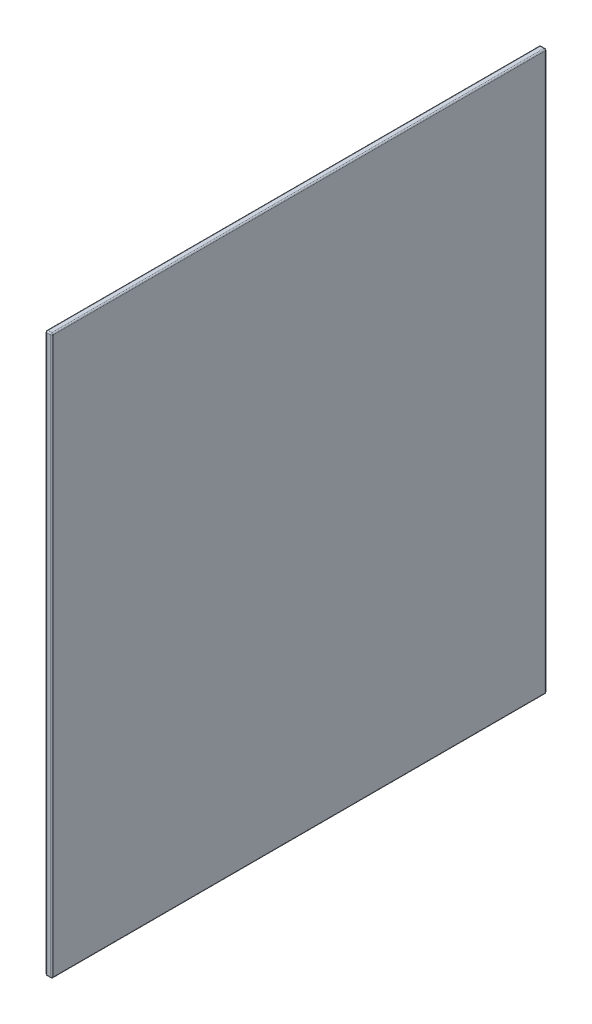
ISO-10303-21;
HEADER;
FILE_DESCRIPTION(('STEP AP214'),'2;1');
FILE_NAME('part.step','',(''),(''),'','','');
FILE_SCHEMA(('AUTOMOTIVE_DESIGN { 1 0 10303 214 1 1 1 1 }'));
ENDSEC;
DATA;
#1=APPLICATION_CONTEXT('core data for automotive mechanical design processes');
#2=APPLICATION_PROTOCOL_DEFINITION('international standard','automotive_design',2000,#1);
#3=PRODUCT_CONTEXT('',#1,'mechanical');
#4=PRODUCT('Part','Part','',(#3));
#5=PRODUCT_RELATED_PRODUCT_CATEGORY('part','',(#4));
#6=PRODUCT_DEFINITION_FORMATION('','',#4);
#7=PRODUCT_DEFINITION_CONTEXT('part definition',#1,'design');
#8=PRODUCT_DEFINITION('design','',#6,#7);
#9=PRODUCT_DEFINITION_SHAPE('','',#8);
#10=(LENGTH_UNIT() NAMED_UNIT(*) SI_UNIT(.MILLI.,.METRE.));
#11=(NAMED_UNIT(*) PLANE_ANGLE_UNIT() SI_UNIT($,.RADIAN.));
#12=(NAMED_UNIT(*) SI_UNIT($,.STERADIAN.) SOLID_ANGLE_UNIT());
#13=UNCERTAINTY_MEASURE_WITH_UNIT(LENGTH_MEASURE(1.E-05),#10,'distance_accuracy_value','');
#14=(GEOMETRIC_REPRESENTATION_CONTEXT(3) GLOBAL_UNCERTAINTY_ASSIGNED_CONTEXT((#13)) GLOBAL_UNIT_ASSIGNED_CONTEXT((#10,
#11,#12)) REPRESENTATION_CONTEXT('',''));
#15=CARTESIAN_POINT('',(0.,0.,0.));
#16=DIRECTION('',(0.,0.,1.));
#17=DIRECTION('',(1.,0.,0.));
#18=AXIS2_PLACEMENT_3D('',#15,#16,#17);
#19=CARTESIAN_POINT('',(4.7625,-207.9625,-184.15));
#20=DIRECTION('',(0.,0.,1.));
#21=DIRECTION('',(1.,0.,0.));
#22=AXIS2_PLACEMENT_3D('',#19,#20,#21);
#23=PLANE('',#22);
#24=DIRECTION('',(0.,1.,0.));
#25=VECTOR('',#24,1.);
#26=CARTESIAN_POINT('',(1.016,207.9625,-184.15));
#27=LINE('',#26,#25);
#28=CARTESIAN_POINT('',(1.016,-206.9465,-184.15));
#29=VERTEX_POINT('',#28);
#30=CARTESIAN_POINT('',(1.016,206.9465,-184.15));
#31=VERTEX_POINT('',#30);
#32=EDGE_CURVE('E279',#29,#31,#27,.T.);
#33=ORIENTED_EDGE('',*,*,#32,.T.);
#34=DIRECTION('',(-1.,0.,0.));
#35=VECTOR('',#34,1.);
#36=CARTESIAN_POINT('',(4.7625,206.9465,-184.15));
#37=LINE('',#36,#35);
#38=CARTESIAN_POINT('',(3.7465,206.9465,-184.15));
#39=VERTEX_POINT('',#38);
#40=EDGE_CURVE('E213',#31,#39,#37,.F.);
#41=ORIENTED_EDGE('',*,*,#40,.T.);
#42=DIRECTION('',(0.,1.,0.));
#43=VECTOR('',#42,1.);
#44=CARTESIAN_POINT('',(3.7465,-207.9625,-184.15));
#45=LINE('',#44,#43);
#46=CARTESIAN_POINT('',(3.7465,-206.9465,-184.15));
#47=VERTEX_POINT('',#46);
#48=EDGE_CURVE('E275',#39,#47,#45,.F.);
#49=ORIENTED_EDGE('',*,*,#48,.T.);
#50=DIRECTION('',(-1.,0.,0.));
#51=VECTOR('',#50,1.);
#52=CARTESIAN_POINT('',(4.7625,-206.9465,-184.15));
#53=LINE('',#52,#51);
#54=EDGE_CURVE('E210',#47,#29,#53,.T.);
#55=ORIENTED_EDGE('',*,*,#54,.T.);
#56=EDGE_LOOP('',(#33,#41,#49,#55));
#57=FACE_BOUND('',#56,.T.);
#58=ADVANCED_FACE('F41',(#57),#23,.F.);
#59=CARTESIAN_POINT('',(4.7625,207.9625,184.15));
#60=DIRECTION('',(0.,-1.,0.));
#61=DIRECTION('',(0.,0.,-1.));
#62=AXIS2_PLACEMENT_3D('',#59,#60,#61);
#63=PLANE('',#62);
#64=DIRECTION('',(0.,0.,1.));
#65=VECTOR('',#64,1.);
#66=CARTESIAN_POINT('',(3.7465,207.9625,184.15));
#67=LINE('',#66,#65);
#68=CARTESIAN_POINT('',(3.7465,207.9625,183.134));
#69=VERTEX_POINT('',#68);
#70=CARTESIAN_POINT('',(3.7465,207.9625,-183.134));
#71=VERTEX_POINT('',#70);
#72=EDGE_CURVE('E231',#69,#71,#67,.F.);
#73=ORIENTED_EDGE('',*,*,#72,.T.);
#74=DIRECTION('',(-1.,0.,0.));
#75=VECTOR('',#74,1.);
#76=CARTESIAN_POINT('',(4.7625,207.9625,-183.134));
#77=LINE('',#76,#75);
#78=CARTESIAN_POINT('',(1.016,207.9625,-183.134));
#79=VERTEX_POINT('',#78);
#80=EDGE_CURVE('E207',#71,#79,#77,.T.);
#81=ORIENTED_EDGE('',*,*,#80,.T.);
#82=DIRECTION('',(0.,0.,1.));
#83=VECTOR('',#82,1.);
#84=CARTESIAN_POINT('',(1.016,207.9625,184.15));
#85=LINE('',#84,#83);
#86=CARTESIAN_POINT('',(1.016,207.9625,183.134));
#87=VERTEX_POINT('',#86);
#88=EDGE_CURVE('E141',#79,#87,#85,.T.);
#89=ORIENTED_EDGE('',*,*,#88,.T.);
#90=DIRECTION('',(-1.,0.,0.));
#91=VECTOR('',#90,1.);
#92=CARTESIAN_POINT('',(4.7625,207.9625,183.134));
#93=LINE('',#92,#91);
#94=EDGE_CURVE('E204',#87,#69,#93,.F.);
#95=ORIENTED_EDGE('',*,*,#94,.T.);
#96=EDGE_LOOP('',(#73,#81,#89,#95));
#97=FACE_BOUND('',#96,.T.);
#98=ADVANCED_FACE('F314',(#97),#63,.F.);
#99=CARTESIAN_POINT('',(4.7625,-207.9625,184.15));
#100=DIRECTION('',(0.,0.,-1.));
#101=DIRECTION('',(-1.,0.,0.));
#102=AXIS2_PLACEMENT_3D('',#99,#100,#101);
#103=PLANE('',#102);
#104=DIRECTION('',(0.,-1.,0.));
#105=VECTOR('',#104,1.);
#106=CARTESIAN_POINT('',(1.016,-207.9625,184.15));
#107=LINE('',#106,#105);
#108=CARTESIAN_POINT('',(1.016,206.9465,184.15));
#109=VERTEX_POINT('',#108);
#110=CARTESIAN_POINT('',(1.016,-206.9465,184.15));
#111=VERTEX_POINT('',#110);
#112=EDGE_CURVE('E260',#109,#111,#107,.T.);
#113=ORIENTED_EDGE('',*,*,#112,.T.);
#114=DIRECTION('',(-1.,0.,0.));
#115=VECTOR('',#114,1.);
#116=CARTESIAN_POINT('',(4.7625,-206.9465,184.15));
#117=LINE('',#116,#115);
#118=CARTESIAN_POINT('',(3.7465,-206.9465,184.15));
#119=VERTEX_POINT('',#118);
#120=EDGE_CURVE('E11',#111,#119,#117,.F.);
#121=ORIENTED_EDGE('',*,*,#120,.T.);
#122=DIRECTION('',(0.,-1.,0.));
#123=VECTOR('',#122,1.);
#124=CARTESIAN_POINT('',(3.7465,-207.9625,184.15));
#125=LINE('',#124,#123);
#126=CARTESIAN_POINT('',(3.7465,206.9465,184.15));
#127=VERTEX_POINT('',#126);
#128=EDGE_CURVE('E168',#119,#127,#125,.F.);
#129=ORIENTED_EDGE('',*,*,#128,.T.);
#130=DIRECTION('',(-1.,0.,0.));
#131=VECTOR('',#130,1.);
#132=CARTESIAN_POINT('',(4.7625,206.9465,184.15));
#133=LINE('',#132,#131);
#134=EDGE_CURVE('E51',#127,#109,#133,.T.);
#135=ORIENTED_EDGE('',*,*,#134,.T.);
#136=EDGE_LOOP('',(#113,#121,#129,#135));
#137=FACE_BOUND('',#136,.T.);
#138=ADVANCED_FACE('F358',(#137),#103,.F.);
#139=CARTESIAN_POINT('',(4.7625,-207.9625,184.15));
#140=DIRECTION('',(0.,1.,0.));
#141=DIRECTION('',(0.,0.,1.));
#142=AXIS2_PLACEMENT_3D('',#139,#140,#141);
#143=PLANE('',#142);
#144=DIRECTION('',(0.,0.,-1.));
#145=VECTOR('',#144,1.);
#146=CARTESIAN_POINT('',(1.016,-207.9625,-184.15));
#147=LINE('',#146,#145);
#148=CARTESIAN_POINT('',(1.016,-207.9625,183.134));
#149=VERTEX_POINT('',#148);
#150=CARTESIAN_POINT('',(1.016,-207.9625,-183.134));
#151=VERTEX_POINT('',#150);
#152=EDGE_CURVE('E268',#149,#151,#147,.T.);
#153=ORIENTED_EDGE('',*,*,#152,.T.);
#154=DIRECTION('',(-1.,0.,0.));
#155=VECTOR('',#154,1.);
#156=CARTESIAN_POINT('',(4.7625,-207.9625,-183.134));
#157=LINE('',#156,#155);
#158=CARTESIAN_POINT('',(3.7465,-207.9625,-183.134));
#159=VERTEX_POINT('',#158);
#160=EDGE_CURVE('E219',#151,#159,#157,.F.);
#161=ORIENTED_EDGE('',*,*,#160,.T.);
#162=DIRECTION('',(0.,0.,-1.));
#163=VECTOR('',#162,1.);
#164=CARTESIAN_POINT('',(3.7465,-207.9625,184.15));
#165=LINE('',#164,#163);
#166=CARTESIAN_POINT('',(3.7465,-207.9625,183.134));
#167=VERTEX_POINT('',#166);
#168=EDGE_CURVE('E263',#159,#167,#165,.F.);
#169=ORIENTED_EDGE('',*,*,#168,.T.);
#170=DIRECTION('',(-1.,0.,0.));
#171=VECTOR('',#170,1.);
#172=CARTESIAN_POINT('',(4.7625,-207.9625,183.134));
#173=LINE('',#172,#171);
#174=EDGE_CURVE('E216',#167,#149,#173,.T.);
#175=ORIENTED_EDGE('',*,*,#174,.T.);
#176=EDGE_LOOP('',(#153,#161,#169,#175));
#177=FACE_BOUND('',#176,.T.);
#178=ADVANCED_FACE('F341',(#177),#143,.F.);
#179=CARTESIAN_POINT('',(4.7625,0.,0.));
#180=DIRECTION('',(-1.,0.,0.));
#181=DIRECTION('',(0.,0.,1.));
#182=AXIS2_PLACEMENT_3D('',#179,#180,#181);
#183=PLANE('',#182);
#184=DIRECTION('',(0.,-1.,0.));
#185=VECTOR('',#184,1.);
#186=CARTESIAN_POINT('',(4.7625,0.,183.134));
#187=LINE('',#186,#185);
#188=CARTESIAN_POINT('',(4.7625,206.9465,183.134));
#189=VERTEX_POINT('',#188);
#190=CARTESIAN_POINT('',(4.7625,-206.9465,183.134));
#191=VERTEX_POINT('',#190);
#192=EDGE_CURVE('E290',#189,#191,#187,.T.);
#193=ORIENTED_EDGE('',*,*,#192,.T.);
#194=DIRECTION('',(0.,0.,-1.));
#195=VECTOR('',#194,1.);
#196=CARTESIAN_POINT('',(4.7625,-206.9465,0.));
#197=LINE('',#196,#195);
#198=CARTESIAN_POINT('',(4.7625,-206.9465,-183.134));
#199=VERTEX_POINT('',#198);
#200=EDGE_CURVE('E294',#191,#199,#197,.T.);
#201=ORIENTED_EDGE('',*,*,#200,.T.);
#202=DIRECTION('',(0.,1.,0.));
#203=VECTOR('',#202,1.);
#204=CARTESIAN_POINT('',(4.7625,0.,-183.134));
#205=LINE('',#204,#203);
#206=CARTESIAN_POINT('',(4.7625,206.9465,-183.134));
#207=VERTEX_POINT('',#206);
#208=EDGE_CURVE('E282',#199,#207,#205,.T.);
#209=ORIENTED_EDGE('',*,*,#208,.T.);
#210=DIRECTION('',(0.,0.,1.));
#211=VECTOR('',#210,1.);
#212=CARTESIAN_POINT('',(4.7625,206.9465,0.));
#213=LINE('',#212,#211);
#214=EDGE_CURVE('E286',#207,#189,#213,.T.);
#215=ORIENTED_EDGE('',*,*,#214,.T.);
#216=EDGE_LOOP('',(#193,#201,#209,#215));
#217=FACE_BOUND('',#216,.T.);
#218=ADVANCED_FACE('F367',(#217),#183,.F.);
#219=CARTESIAN_POINT('',(0.,0.,0.));
#220=DIRECTION('',(-1.,0.,0.));
#221=DIRECTION('',(0.,0.,1.));
#222=AXIS2_PLACEMENT_3D('',#219,#220,#221);
#223=PLANE('',#222);
#224=DIRECTION('',(0.,-1.,0.));
#225=VECTOR('',#224,1.);
#226=CARTESIAN_POINT('',(0.,207.9625,183.134));
#227=LINE('',#226,#225);
#228=CARTESIAN_POINT('',(0.,-206.9465,183.134));
#229=VERTEX_POINT('',#228);
#230=CARTESIAN_POINT('',(0.,206.9465,183.134));
#231=VERTEX_POINT('',#230);
#232=EDGE_CURVE('E166',#229,#231,#227,.F.);
#233=ORIENTED_EDGE('',*,*,#232,.T.);
#234=DIRECTION('',(0.,0.,1.));
#235=VECTOR('',#234,1.);
#236=CARTESIAN_POINT('',(0.,206.9465,-184.15));
#237=LINE('',#236,#235);
#238=CARTESIAN_POINT('',(0.,206.9465,-183.134));
#239=VERTEX_POINT('',#238);
#240=EDGE_CURVE('E138',#231,#239,#237,.F.);
#241=ORIENTED_EDGE('',*,*,#240,.T.);
#242=DIRECTION('',(0.,1.,0.));
#243=VECTOR('',#242,1.);
#244=CARTESIAN_POINT('',(0.,-207.9625,-183.134));
#245=LINE('',#244,#243);
#246=CARTESIAN_POINT('',(0.,-206.9465,-183.134));
#247=VERTEX_POINT('',#246);
#248=EDGE_CURVE('E152',#239,#247,#245,.F.);
#249=ORIENTED_EDGE('',*,*,#248,.T.);
#250=DIRECTION('',(0.,0.,-1.));
#251=VECTOR('',#250,1.);
#252=CARTESIAN_POINT('',(0.,-206.9465,184.15));
#253=LINE('',#252,#251);
#254=EDGE_CURVE('E162',#247,#229,#253,.F.);
#255=ORIENTED_EDGE('',*,*,#254,.T.);
#256=EDGE_LOOP('',(#233,#241,#249,#255));
#257=FACE_BOUND('',#256,.T.);
#258=ADVANCED_FACE('F165',(#257),#223,.T.);
#259=CARTESIAN_POINT('',(1.016,-206.9465,184.15));
#260=DIRECTION('',(0.,0.,1.));
#261=DIRECTION('',(1.,0.,0.));
#262=AXIS2_PLACEMENT_3D('',#259,#260,#261);
#263=CYLINDRICAL_SURFACE('',#262,1.016);
#264=ORIENTED_EDGE('',*,*,#254,.F.);
#265=CARTESIAN_POINT('',(1.016,-206.9465,-183.134));
#266=DIRECTION('',(0.,0.,1.));
#267=DIRECTION('',(1.,0.,0.));
#268=AXIS2_PLACEMENT_3D('',#265,#266,#267);
#269=CIRCLE('',#268,1.016);
#270=EDGE_CURVE('E189',#247,#151,#269,.T.);
#271=ORIENTED_EDGE('',*,*,#270,.T.);
#272=ORIENTED_EDGE('',*,*,#152,.F.);
#273=CARTESIAN_POINT('',(1.016,-206.9465,183.134));
#274=DIRECTION('',(0.,0.,1.));
#275=DIRECTION('',(1.,0.,0.));
#276=AXIS2_PLACEMENT_3D('',#273,#274,#275);
#277=CIRCLE('',#276,1.016);
#278=EDGE_CURVE('E186',#149,#229,#277,.F.);
#279=ORIENTED_EDGE('',*,*,#278,.T.);
#280=EDGE_LOOP('',(#264,#271,#272,#279));
#281=FACE_BOUND('',#280,.T.);
#282=ADVANCED_FACE('F327',(#281),#263,.T.);
#283=CARTESIAN_POINT('',(1.016,-207.9625,-183.134));
#284=DIRECTION('',(0.,-1.,0.));
#285=DIRECTION('',(0.,0.,-1.));
#286=AXIS2_PLACEMENT_3D('',#283,#284,#285);
#287=CYLINDRICAL_SURFACE('',#286,1.016);
#288=ORIENTED_EDGE('',*,*,#248,.F.);
#289=CARTESIAN_POINT('',(1.016,206.9465,-183.134));
#290=DIRECTION('',(0.,-1.,0.));
#291=DIRECTION('',(0.,0.,-1.));
#292=AXIS2_PLACEMENT_3D('',#289,#290,#291);
#293=CIRCLE('',#292,1.016);
#294=EDGE_CURVE('E155',#239,#31,#293,.T.);
#295=ORIENTED_EDGE('',*,*,#294,.T.);
#296=ORIENTED_EDGE('',*,*,#32,.F.);
#297=CARTESIAN_POINT('',(1.016,-206.9465,-183.134));
#298=DIRECTION('',(0.,-1.,0.));
#299=DIRECTION('',(0.,0.,-1.));
#300=AXIS2_PLACEMENT_3D('',#297,#298,#299);
#301=CIRCLE('',#300,1.016);
#302=EDGE_CURVE('E147',#29,#247,#301,.F.);
#303=ORIENTED_EDGE('',*,*,#302,.T.);
#304=EDGE_LOOP('',(#288,#295,#296,#303));
#305=FACE_BOUND('',#304,.T.);
#306=ADVANCED_FACE('F153',(#305),#287,.T.);
#307=CARTESIAN_POINT('',(1.016,-207.9625,183.134));
#308=DIRECTION('',(0.,1.,0.));
#309=DIRECTION('',(0.,0.,1.));
#310=AXIS2_PLACEMENT_3D('',#307,#308,#309);
#311=CYLINDRICAL_SURFACE('',#310,1.016);
#312=ORIENTED_EDGE('',*,*,#232,.F.);
#313=CARTESIAN_POINT('',(1.016,-206.9465,183.134));
#314=DIRECTION('',(0.,1.,0.));
#315=DIRECTION('',(0.,0.,1.));
#316=AXIS2_PLACEMENT_3D('',#313,#314,#315);
#317=CIRCLE('',#316,1.016);
#318=EDGE_CURVE('E59',#229,#111,#317,.T.);
#319=ORIENTED_EDGE('',*,*,#318,.T.);
#320=ORIENTED_EDGE('',*,*,#112,.F.);
#321=CARTESIAN_POINT('',(1.016,206.9465,183.134));
#322=DIRECTION('',(0.,1.,0.));
#323=DIRECTION('',(0.,0.,1.));
#324=AXIS2_PLACEMENT_3D('',#321,#322,#323);
#325=CIRCLE('',#324,1.016);
#326=EDGE_CURVE('E199',#109,#231,#325,.F.);
#327=ORIENTED_EDGE('',*,*,#326,.T.);
#328=EDGE_LOOP('',(#312,#319,#320,#327));
#329=FACE_BOUND('',#328,.T.);
#330=ADVANCED_FACE('F259',(#329),#311,.T.);
#331=CARTESIAN_POINT('',(1.016,206.9465,184.15));
#332=DIRECTION('',(0.,0.,-1.));
#333=DIRECTION('',(-1.,0.,0.));
#334=AXIS2_PLACEMENT_3D('',#331,#332,#333);
#335=CYLINDRICAL_SURFACE('',#334,1.016);
#336=ORIENTED_EDGE('',*,*,#88,.F.);
#337=CARTESIAN_POINT('',(1.016,206.9465,-183.134));
#338=DIRECTION('',(0.,0.,-1.));
#339=DIRECTION('',(-1.,0.,0.));
#340=AXIS2_PLACEMENT_3D('',#337,#338,#339);
#341=CIRCLE('',#340,1.016);
#342=EDGE_CURVE('E134',#79,#239,#341,.F.);
#343=ORIENTED_EDGE('',*,*,#342,.T.);
#344=ORIENTED_EDGE('',*,*,#240,.F.);
#345=CARTESIAN_POINT('',(1.016,206.9465,183.134));
#346=DIRECTION('',(0.,0.,-1.));
#347=DIRECTION('',(-1.,0.,0.));
#348=AXIS2_PLACEMENT_3D('',#345,#346,#347);
#349=CIRCLE('',#348,1.016);
#350=EDGE_CURVE('E148',#231,#87,#349,.T.);
#351=ORIENTED_EDGE('',*,*,#350,.T.);
#352=EDGE_LOOP('',(#336,#343,#344,#351));
#353=FACE_BOUND('',#352,.T.);
#354=ADVANCED_FACE('F136',(#353),#335,.T.);
#355=CARTESIAN_POINT('',(3.7465,206.9465,0.));
#356=DIRECTION('',(0.,0.,1.));
#357=DIRECTION('',(1.,0.,0.));
#358=AXIS2_PLACEMENT_3D('',#355,#356,#357);
#359=CYLINDRICAL_SURFACE('',#358,1.016);
#360=ORIENTED_EDGE('',*,*,#214,.F.);
#361=CARTESIAN_POINT('',(3.7465,206.9465,-183.134));
#362=DIRECTION('',(0.,0.,1.));
#363=DIRECTION('',(1.,0.,0.));
#364=AXIS2_PLACEMENT_3D('',#361,#362,#363);
#365=CIRCLE('',#364,1.016);
#366=EDGE_CURVE('E308',#207,#71,#365,.T.);
#367=ORIENTED_EDGE('',*,*,#366,.T.);
#368=ORIENTED_EDGE('',*,*,#72,.F.);
#369=CARTESIAN_POINT('',(3.7465,206.9465,183.134));
#370=DIRECTION('',(0.,0.,1.));
#371=DIRECTION('',(1.,0.,0.));
#372=AXIS2_PLACEMENT_3D('',#369,#370,#371);
#373=CIRCLE('',#372,1.016);
#374=EDGE_CURVE('E305',#69,#189,#373,.F.);
#375=ORIENTED_EDGE('',*,*,#374,.T.);
#376=EDGE_LOOP('',(#360,#367,#368,#375));
#377=FACE_BOUND('',#376,.T.);
#378=ADVANCED_FACE('F365',(#377),#359,.T.);
#379=CARTESIAN_POINT('',(3.7465,0.,183.134));
#380=DIRECTION('',(0.,-1.,0.));
#381=DIRECTION('',(0.,0.,-1.));
#382=AXIS2_PLACEMENT_3D('',#379,#380,#381);
#383=CYLINDRICAL_SURFACE('',#382,1.016);
#384=ORIENTED_EDGE('',*,*,#128,.F.);
#385=CARTESIAN_POINT('',(3.7465,-206.9465,183.134));
#386=DIRECTION('',(0.,-1.,0.));
#387=DIRECTION('',(0.,0.,-1.));
#388=AXIS2_PLACEMENT_3D('',#385,#386,#387);
#389=CIRCLE('',#388,1.016);
#390=EDGE_CURVE('E196',#119,#191,#389,.F.);
#391=ORIENTED_EDGE('',*,*,#390,.T.);
#392=ORIENTED_EDGE('',*,*,#192,.F.);
#393=CARTESIAN_POINT('',(3.7465,206.9465,183.134));
#394=DIRECTION('',(0.,-1.,0.));
#395=DIRECTION('',(0.,0.,-1.));
#396=AXIS2_PLACEMENT_3D('',#393,#394,#395);
#397=CIRCLE('',#396,1.016);
#398=EDGE_CURVE('E192',#189,#127,#397,.T.);
#399=ORIENTED_EDGE('',*,*,#398,.T.);
#400=EDGE_LOOP('',(#384,#391,#392,#399));
#401=FACE_BOUND('',#400,.T.);
#402=ADVANCED_FACE('F360',(#401),#383,.T.);
#403=CARTESIAN_POINT('',(3.7465,0.,-183.134));
#404=DIRECTION('',(0.,1.,0.));
#405=DIRECTION('',(0.,0.,1.));
#406=AXIS2_PLACEMENT_3D('',#403,#404,#405);
#407=CYLINDRICAL_SURFACE('',#406,1.016);
#408=ORIENTED_EDGE('',*,*,#48,.F.);
#409=CARTESIAN_POINT('',(3.7465,206.9465,-183.134));
#410=DIRECTION('',(0.,1.,0.));
#411=DIRECTION('',(0.,0.,1.));
#412=AXIS2_PLACEMENT_3D('',#409,#410,#411);
#413=CIRCLE('',#412,1.016);
#414=EDGE_CURVE('E301',#39,#207,#413,.F.);
#415=ORIENTED_EDGE('',*,*,#414,.T.);
#416=ORIENTED_EDGE('',*,*,#208,.F.);
#417=CARTESIAN_POINT('',(3.7465,-206.9465,-183.134));
#418=DIRECTION('',(0.,1.,0.));
#419=DIRECTION('',(0.,0.,1.));
#420=AXIS2_PLACEMENT_3D('',#417,#418,#419);
#421=CIRCLE('',#420,1.016);
#422=EDGE_CURVE('E298',#199,#47,#421,.T.);
#423=ORIENTED_EDGE('',*,*,#422,.T.);
#424=EDGE_LOOP('',(#408,#415,#416,#423));
#425=FACE_BOUND('',#424,.T.);
#426=ADVANCED_FACE('F370',(#425),#407,.T.);
#427=CARTESIAN_POINT('',(3.7465,-206.9465,0.));
#428=DIRECTION('',(0.,0.,-1.));
#429=DIRECTION('',(-1.,0.,0.));
#430=AXIS2_PLACEMENT_3D('',#427,#428,#429);
#431=CYLINDRICAL_SURFACE('',#430,1.016);
#432=ORIENTED_EDGE('',*,*,#168,.F.);
#433=CARTESIAN_POINT('',(3.7465,-206.9465,-183.134));
#434=DIRECTION('',(0.,0.,-1.));
#435=DIRECTION('',(-1.,0.,0.));
#436=AXIS2_PLACEMENT_3D('',#433,#434,#435);
#437=CIRCLE('',#436,1.016);
#438=EDGE_CURVE('E179',#159,#199,#437,.F.);
#439=ORIENTED_EDGE('',*,*,#438,.T.);
#440=ORIENTED_EDGE('',*,*,#200,.F.);
#441=CARTESIAN_POINT('',(3.7465,-206.9465,183.134));
#442=DIRECTION('',(0.,0.,-1.));
#443=DIRECTION('',(-1.,0.,0.));
#444=AXIS2_PLACEMENT_3D('',#441,#442,#443);
#445=CIRCLE('',#444,1.016);
#446=EDGE_CURVE('E174',#191,#167,#445,.T.);
#447=ORIENTED_EDGE('',*,*,#446,.T.);
#448=EDGE_LOOP('',(#432,#439,#440,#447));
#449=FACE_BOUND('',#448,.T.);
#450=ADVANCED_FACE('F343',(#449),#431,.T.);
#451=CARTESIAN_POINT('',(1.016,206.9465,-183.134));
#452=DIRECTION('',(0.,0.,1.));
#453=DIRECTION('',(1.,0.,0.));
#454=AXIS2_PLACEMENT_3D('',#451,#452,#453);
#455=SPHERICAL_SURFACE('',#454,1.016);
#456=ORIENTED_EDGE('',*,*,#294,.F.);
#457=ORIENTED_EDGE('',*,*,#342,.F.);
#458=CARTESIAN_POINT('',(1.016,206.9465,-183.134));
#459=DIRECTION('',(1.,0.,0.));
#460=DIRECTION('',(0.,0.,-1.));
#461=AXIS2_PLACEMENT_3D('',#458,#459,#460);
#462=CIRCLE('',#461,1.016);
#463=EDGE_CURVE('E171',#31,#79,#462,.T.);
#464=ORIENTED_EDGE('',*,*,#463,.F.);
#465=EDGE_LOOP('',(#456,#457,#464));
#466=FACE_BOUND('',#465,.T.);
#467=ADVANCED_FACE('F170',(#466),#455,.T.);
#468=CARTESIAN_POINT('',(4.7625,206.9465,-183.134));
#469=DIRECTION('',(-1.,0.,0.));
#470=DIRECTION('',(0.,0.,1.));
#471=AXIS2_PLACEMENT_3D('',#468,#469,#470);
#472=CYLINDRICAL_SURFACE('',#471,1.016);
#473=ORIENTED_EDGE('',*,*,#463,.T.);
#474=ORIENTED_EDGE('',*,*,#80,.F.);
#475=CARTESIAN_POINT('',(3.7465,206.9465,-183.134));
#476=DIRECTION('',(1.,0.,0.));
#477=DIRECTION('',(0.,0.,-1.));
#478=AXIS2_PLACEMENT_3D('',#475,#476,#477);
#479=CIRCLE('',#478,1.016);
#480=EDGE_CURVE('E224',#39,#71,#479,.T.);
#481=ORIENTED_EDGE('',*,*,#480,.F.);
#482=ORIENTED_EDGE('',*,*,#40,.F.);
#483=EDGE_LOOP('',(#473,#474,#481,#482));
#484=FACE_BOUND('',#483,.T.);
#485=ADVANCED_FACE('F376',(#484),#472,.T.);
#486=CARTESIAN_POINT('',(3.7465,206.9465,-183.134));
#487=DIRECTION('',(0.,0.,1.));
#488=DIRECTION('',(1.,0.,0.));
#489=AXIS2_PLACEMENT_3D('',#486,#487,#488);
#490=SPHERICAL_SURFACE('',#489,1.016);
#491=ORIENTED_EDGE('',*,*,#480,.T.);
#492=ORIENTED_EDGE('',*,*,#366,.F.);
#493=ORIENTED_EDGE('',*,*,#414,.F.);
#494=EDGE_LOOP('',(#491,#492,#493));
#495=FACE_BOUND('',#494,.T.);
#496=ADVANCED_FACE('F374',(#495),#490,.T.);
#497=CARTESIAN_POINT('',(1.016,-206.9465,-183.134));
#498=DIRECTION('',(0.,0.,1.));
#499=DIRECTION('',(1.,0.,0.));
#500=AXIS2_PLACEMENT_3D('',#497,#498,#499);
#501=SPHERICAL_SURFACE('',#500,1.016);
#502=ORIENTED_EDGE('',*,*,#270,.F.);
#503=ORIENTED_EDGE('',*,*,#302,.F.);
#504=CARTESIAN_POINT('',(1.016,-206.9465,-183.134));
#505=DIRECTION('',(1.,0.,0.));
#506=DIRECTION('',(0.,0.,-1.));
#507=AXIS2_PLACEMENT_3D('',#504,#505,#506);
#508=CIRCLE('',#507,1.016);
#509=EDGE_CURVE('E228',#151,#29,#508,.T.);
#510=ORIENTED_EDGE('',*,*,#509,.F.);
#511=EDGE_LOOP('',(#502,#503,#510));
#512=FACE_BOUND('',#511,.T.);
#513=ADVANCED_FACE('F332',(#512),#501,.T.);
#514=CARTESIAN_POINT('',(4.7625,-206.9465,-183.134));
#515=DIRECTION('',(-1.,0.,0.));
#516=DIRECTION('',(0.,0.,1.));
#517=AXIS2_PLACEMENT_3D('',#514,#515,#516);
#518=CYLINDRICAL_SURFACE('',#517,1.016);
#519=ORIENTED_EDGE('',*,*,#509,.T.);
#520=ORIENTED_EDGE('',*,*,#54,.F.);
#521=CARTESIAN_POINT('',(3.7465,-206.9465,-183.134));
#522=DIRECTION('',(1.,0.,0.));
#523=DIRECTION('',(0.,0.,-1.));
#524=AXIS2_PLACEMENT_3D('',#521,#522,#523);
#525=CIRCLE('',#524,1.016);
#526=EDGE_CURVE('E232',#159,#47,#525,.T.);
#527=ORIENTED_EDGE('',*,*,#526,.F.);
#528=ORIENTED_EDGE('',*,*,#160,.F.);
#529=EDGE_LOOP('',(#519,#520,#527,#528));
#530=FACE_BOUND('',#529,.T.);
#531=ADVANCED_FACE('F337',(#530),#518,.T.);
#532=CARTESIAN_POINT('',(3.7465,-206.9465,-183.134));
#533=DIRECTION('',(0.,0.,1.));
#534=DIRECTION('',(1.,0.,0.));
#535=AXIS2_PLACEMENT_3D('',#532,#533,#534);
#536=SPHERICAL_SURFACE('',#535,1.016);
#537=ORIENTED_EDGE('',*,*,#526,.T.);
#538=ORIENTED_EDGE('',*,*,#422,.F.);
#539=ORIENTED_EDGE('',*,*,#438,.F.);
#540=EDGE_LOOP('',(#537,#538,#539));
#541=FACE_BOUND('',#540,.T.);
#542=ADVANCED_FACE('F379',(#541),#536,.T.);
#543=CARTESIAN_POINT('',(1.016,-206.9465,183.134));
#544=DIRECTION('',(0.,0.,1.));
#545=DIRECTION('',(1.,0.,0.));
#546=AXIS2_PLACEMENT_3D('',#543,#544,#545);
#547=SPHERICAL_SURFACE('',#546,1.016);
#548=ORIENTED_EDGE('',*,*,#318,.F.);
#549=ORIENTED_EDGE('',*,*,#278,.F.);
#550=CARTESIAN_POINT('',(1.016,-206.9465,183.134));
#551=DIRECTION('',(1.,0.,0.));
#552=DIRECTION('',(0.,0.,-1.));
#553=AXIS2_PLACEMENT_3D('',#550,#551,#552);
#554=CIRCLE('',#553,1.016);
#555=EDGE_CURVE('E236',#111,#149,#554,.T.);
#556=ORIENTED_EDGE('',*,*,#555,.F.);
#557=EDGE_LOOP('',(#548,#549,#556));
#558=FACE_BOUND('',#557,.T.);
#559=ADVANCED_FACE('F356',(#558),#547,.T.);
#560=CARTESIAN_POINT('',(4.7625,-206.9465,183.134));
#561=DIRECTION('',(-1.,0.,0.));
#562=DIRECTION('',(0.,0.,1.));
#563=AXIS2_PLACEMENT_3D('',#560,#561,#562);
#564=CYLINDRICAL_SURFACE('',#563,1.016);
#565=ORIENTED_EDGE('',*,*,#555,.T.);
#566=ORIENTED_EDGE('',*,*,#174,.F.);
#567=CARTESIAN_POINT('',(3.7465,-206.9465,183.134));
#568=DIRECTION('',(1.,0.,0.));
#569=DIRECTION('',(0.,0.,-1.));
#570=AXIS2_PLACEMENT_3D('',#567,#568,#569);
#571=CIRCLE('',#570,1.016);
#572=EDGE_CURVE('E240',#119,#167,#571,.T.);
#573=ORIENTED_EDGE('',*,*,#572,.F.);
#574=ORIENTED_EDGE('',*,*,#120,.F.);
#575=EDGE_LOOP('',(#565,#566,#573,#574));
#576=FACE_BOUND('',#575,.T.);
#577=ADVANCED_FACE('F354',(#576),#564,.T.);
#578=CARTESIAN_POINT('',(3.7465,-206.9465,183.134));
#579=DIRECTION('',(0.,0.,1.));
#580=DIRECTION('',(1.,0.,0.));
#581=AXIS2_PLACEMENT_3D('',#578,#579,#580);
#582=SPHERICAL_SURFACE('',#581,1.016);
#583=ORIENTED_EDGE('',*,*,#446,.F.);
#584=ORIENTED_EDGE('',*,*,#390,.F.);
#585=ORIENTED_EDGE('',*,*,#572,.T.);
#586=EDGE_LOOP('',(#583,#584,#585));
#587=FACE_BOUND('',#586,.T.);
#588=ADVANCED_FACE('F349',(#587),#582,.T.);
#589=CARTESIAN_POINT('',(1.016,206.9465,183.134));
#590=DIRECTION('',(0.,0.,1.));
#591=DIRECTION('',(1.,0.,0.));
#592=AXIS2_PLACEMENT_3D('',#589,#590,#591);
#593=SPHERICAL_SURFACE('',#592,1.016);
#594=ORIENTED_EDGE('',*,*,#350,.F.);
#595=ORIENTED_EDGE('',*,*,#326,.F.);
#596=CARTESIAN_POINT('',(1.016,206.9465,183.134));
#597=DIRECTION('',(1.,0.,0.));
#598=DIRECTION('',(0.,0.,-1.));
#599=AXIS2_PLACEMENT_3D('',#596,#597,#598);
#600=CIRCLE('',#599,1.016);
#601=EDGE_CURVE('E45',#87,#109,#600,.T.);
#602=ORIENTED_EDGE('',*,*,#601,.F.);
#603=EDGE_LOOP('',(#594,#595,#602));
#604=FACE_BOUND('',#603,.T.);
#605=ADVANCED_FACE('F43',(#604),#593,.T.);
#606=CARTESIAN_POINT('',(4.7625,206.9465,183.134));
#607=DIRECTION('',(-1.,0.,0.));
#608=DIRECTION('',(0.,0.,1.));
#609=AXIS2_PLACEMENT_3D('',#606,#607,#608);
#610=CYLINDRICAL_SURFACE('',#609,1.016);
#611=ORIENTED_EDGE('',*,*,#601,.T.);
#612=ORIENTED_EDGE('',*,*,#134,.F.);
#613=CARTESIAN_POINT('',(3.7465,206.9465,183.134));
#614=DIRECTION('',(1.,0.,0.));
#615=DIRECTION('',(0.,0.,-1.));
#616=AXIS2_PLACEMENT_3D('',#613,#614,#615);
#617=CIRCLE('',#616,1.016);
#618=EDGE_CURVE('E245',#69,#127,#617,.T.);
#619=ORIENTED_EDGE('',*,*,#618,.F.);
#620=ORIENTED_EDGE('',*,*,#94,.F.);
#621=EDGE_LOOP('',(#611,#612,#619,#620));
#622=FACE_BOUND('',#621,.T.);
#623=ADVANCED_FACE('F256',(#622),#610,.T.);
#624=CARTESIAN_POINT('',(3.7465,206.9465,183.134));
#625=DIRECTION('',(0.,0.,1.));
#626=DIRECTION('',(1.,0.,0.));
#627=AXIS2_PLACEMENT_3D('',#624,#625,#626);
#628=SPHERICAL_SURFACE('',#627,1.016);
#629=ORIENTED_EDGE('',*,*,#398,.F.);
#630=ORIENTED_EDGE('',*,*,#374,.F.);
#631=ORIENTED_EDGE('',*,*,#618,.T.);
#632=EDGE_LOOP('',(#629,#630,#631));
#633=FACE_BOUND('',#632,.T.);
#634=ADVANCED_FACE('F362',(#633),#628,.T.);
#635=CLOSED_SHELL('',(#58,#98,#138,#178,#218,#258,#282,#306,#330,#354,#378,#402,#426,#450,#467,
#485,#496,#513,#531,#542,#559,#577,#588,#605,#623,#634));
#636=MANIFOLD_SOLID_BREP('B2',#635);
#637=ADVANCED_BREP_SHAPE_REPRESENTATION('',(#18,#636),#14);
#638=SHAPE_DEFINITION_REPRESENTATION(#9,#637);
ENDSEC;
END-ISO-10303-21;
